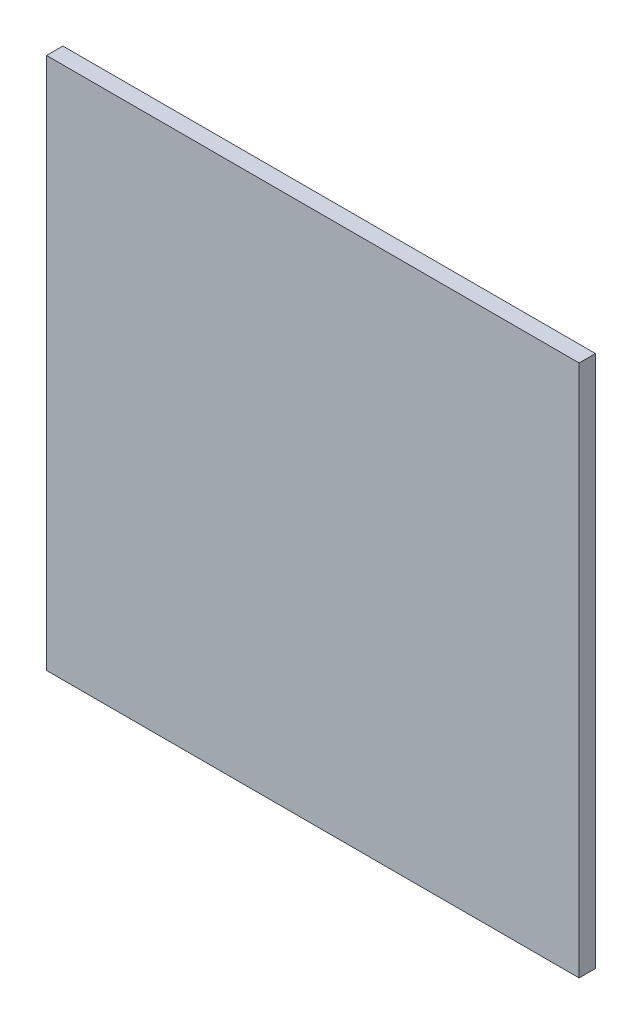
ISO-10303-21;
HEADER;
FILE_DESCRIPTION(('STEP AP214'),'2;1');
FILE_NAME('part.step','',(''),(''),'','','');
FILE_SCHEMA(('AUTOMOTIVE_DESIGN { 1 0 10303 214 1 1 1 1 }'));
ENDSEC;
DATA;
#1=APPLICATION_CONTEXT('core data for automotive mechanical design processes');
#2=APPLICATION_PROTOCOL_DEFINITION('international standard','automotive_design',2000,#1);
#3=PRODUCT_CONTEXT('',#1,'mechanical');
#4=PRODUCT('Part','Part','',(#3));
#5=PRODUCT_RELATED_PRODUCT_CATEGORY('part','',(#4));
#6=PRODUCT_DEFINITION_FORMATION('','',#4);
#7=PRODUCT_DEFINITION_CONTEXT('part definition',#1,'design');
#8=PRODUCT_DEFINITION('design','',#6,#7);
#9=PRODUCT_DEFINITION_SHAPE('','',#8);
#10=(LENGTH_UNIT() NAMED_UNIT(*) SI_UNIT(.MILLI.,.METRE.));
#11=(NAMED_UNIT(*) PLANE_ANGLE_UNIT() SI_UNIT($,.RADIAN.));
#12=(NAMED_UNIT(*) SI_UNIT($,.STERADIAN.) SOLID_ANGLE_UNIT());
#13=UNCERTAINTY_MEASURE_WITH_UNIT(LENGTH_MEASURE(1.E-05),#10,'distance_accuracy_value','');
#14=(GEOMETRIC_REPRESENTATION_CONTEXT(3) GLOBAL_UNCERTAINTY_ASSIGNED_CONTEXT((#13)) GLOBAL_UNIT_ASSIGNED_CONTEXT((#10,
#11,#12)) REPRESENTATION_CONTEXT('',''));
#15=CARTESIAN_POINT('',(0.,0.,0.));
#16=DIRECTION('',(0.,0.,1.));
#17=DIRECTION('',(1.,0.,0.));
#18=AXIS2_PLACEMENT_3D('',#15,#16,#17);
#19=CARTESIAN_POINT('',(266.243807327655,222.18972550358,2.3));
#20=DIRECTION('',(1.,0.,0.));
#21=DIRECTION('',(0.,1.,0.));
#22=AXIS2_PLACEMENT_3D('',#19,#20,#21);
#23=PLANE('',#22);
#24=DIRECTION('',(0.,-1.,0.));
#25=VECTOR('',#24,1.);
#26=CARTESIAN_POINT('',(266.243807327655,222.18972550358,0.));
#27=LINE('',#26,#25);
#28=CARTESIAN_POINT('',(266.243807327655,222.18972550358,0.));
#29=VERTEX_POINT('',#28);
#30=CARTESIAN_POINT('',(266.243807327655,147.18972550358,0.));
#31=VERTEX_POINT('',#30);
#32=EDGE_CURVE('E100',#29,#31,#27,.T.);
#33=ORIENTED_EDGE('',*,*,#32,.T.);
#34=DIRECTION('',(0.,0.,-1.));
#35=VECTOR('',#34,1.);
#36=CARTESIAN_POINT('',(266.243807327655,147.18972550358,2.3));
#37=LINE('',#36,#35);
#38=CARTESIAN_POINT('',(266.243807327655,147.18972550358,2.3));
#39=VERTEX_POINT('',#38);
#40=EDGE_CURVE('E11',#39,#31,#37,.T.);
#41=ORIENTED_EDGE('',*,*,#40,.F.);
#42=DIRECTION('',(0.,-1.,0.));
#43=VECTOR('',#42,1.);
#44=CARTESIAN_POINT('',(266.243807327655,222.18972550358,2.3));
#45=LINE('',#44,#43);
#46=CARTESIAN_POINT('',(266.243807327655,222.18972550358,2.3));
#47=VERTEX_POINT('',#46);
#48=EDGE_CURVE('E88',#47,#39,#45,.T.);
#49=ORIENTED_EDGE('',*,*,#48,.F.);
#50=DIRECTION('',(0.,0.,-1.));
#51=VECTOR('',#50,1.);
#52=CARTESIAN_POINT('',(266.243807327655,222.18972550358,2.3));
#53=LINE('',#52,#51);
#54=EDGE_CURVE('E96',#47,#29,#53,.T.);
#55=ORIENTED_EDGE('',*,*,#54,.T.);
#56=EDGE_LOOP('',(#33,#41,#49,#55));
#57=FACE_BOUND('',#56,.T.);
#58=ADVANCED_FACE('F37',(#57),#23,.F.);
#59=CARTESIAN_POINT('',(266.243807327655,147.18972550358,2.3));
#60=DIRECTION('',(0.,1.,0.));
#61=DIRECTION('',(0.,0.,1.));
#62=AXIS2_PLACEMENT_3D('',#59,#60,#61);
#63=PLANE('',#62);
#64=DIRECTION('',(1.,0.,0.));
#65=VECTOR('',#64,1.);
#66=CARTESIAN_POINT('',(266.243807327655,147.18972550358,0.));
#67=LINE('',#66,#65);
#68=CARTESIAN_POINT('',(341.243807327655,147.18972550358,0.));
#69=VERTEX_POINT('',#68);
#70=EDGE_CURVE('E92',#31,#69,#67,.T.);
#71=ORIENTED_EDGE('',*,*,#70,.T.);
#72=DIRECTION('',(0.,0.,-1.));
#73=VECTOR('',#72,1.);
#74=CARTESIAN_POINT('',(341.243807327655,147.18972550358,2.3));
#75=LINE('',#74,#73);
#76=CARTESIAN_POINT('',(341.243807327655,147.18972550358,2.3));
#77=VERTEX_POINT('',#76);
#78=EDGE_CURVE('E45',#77,#69,#75,.T.);
#79=ORIENTED_EDGE('',*,*,#78,.F.);
#80=DIRECTION('',(1.,0.,0.));
#81=VECTOR('',#80,1.);
#82=CARTESIAN_POINT('',(266.243807327655,147.18972550358,2.3));
#83=LINE('',#82,#81);
#84=EDGE_CURVE('E83',#39,#77,#83,.T.);
#85=ORIENTED_EDGE('',*,*,#84,.F.);
#86=ORIENTED_EDGE('',*,*,#40,.T.);
#87=EDGE_LOOP('',(#71,#79,#85,#86));
#88=FACE_BOUND('',#87,.T.);
#89=ADVANCED_FACE('F91',(#88),#63,.F.);
#90=CARTESIAN_POINT('',(341.243807327655,222.18972550358,2.3));
#91=DIRECTION('',(-1.,0.,0.));
#92=DIRECTION('',(0.,0.,1.));
#93=AXIS2_PLACEMENT_3D('',#90,#91,#92);
#94=PLANE('',#93);
#95=DIRECTION('',(0.,1.,0.));
#96=VECTOR('',#95,1.);
#97=CARTESIAN_POINT('',(341.243807327655,222.18972550358,0.));
#98=LINE('',#97,#96);
#99=CARTESIAN_POINT('',(341.243807327655,222.18972550358,0.));
#100=VERTEX_POINT('',#99);
#101=EDGE_CURVE('E70',#69,#100,#98,.T.);
#102=ORIENTED_EDGE('',*,*,#101,.T.);
#103=DIRECTION('',(0.,0.,-1.));
#104=VECTOR('',#103,1.);
#105=CARTESIAN_POINT('',(341.243807327655,222.18972550358,2.3));
#106=LINE('',#105,#104);
#107=CARTESIAN_POINT('',(341.243807327655,222.18972550358,2.3));
#108=VERTEX_POINT('',#107);
#109=EDGE_CURVE('E93',#108,#100,#106,.T.);
#110=ORIENTED_EDGE('',*,*,#109,.F.);
#111=DIRECTION('',(0.,1.,0.));
#112=VECTOR('',#111,1.);
#113=CARTESIAN_POINT('',(341.243807327655,222.18972550358,2.3));
#114=LINE('',#113,#112);
#115=EDGE_CURVE('E86',#77,#108,#114,.T.);
#116=ORIENTED_EDGE('',*,*,#115,.F.);
#117=ORIENTED_EDGE('',*,*,#78,.T.);
#118=EDGE_LOOP('',(#102,#110,#116,#117));
#119=FACE_BOUND('',#118,.T.);
#120=ADVANCED_FACE('F94',(#119),#94,.F.);
#121=CARTESIAN_POINT('',(266.243807327655,222.18972550358,2.3));
#122=DIRECTION('',(0.,-1.,0.));
#123=DIRECTION('',(0.,0.,-1.));
#124=AXIS2_PLACEMENT_3D('',#121,#122,#123);
#125=PLANE('',#124);
#126=DIRECTION('',(-1.,0.,0.));
#127=VECTOR('',#126,1.);
#128=CARTESIAN_POINT('',(266.243807327655,222.18972550358,0.));
#129=LINE('',#128,#127);
#130=EDGE_CURVE('E76',#100,#29,#129,.T.);
#131=ORIENTED_EDGE('',*,*,#130,.T.);
#132=ORIENTED_EDGE('',*,*,#54,.F.);
#133=DIRECTION('',(-1.,0.,0.));
#134=VECTOR('',#133,1.);
#135=CARTESIAN_POINT('',(266.243807327655,222.18972550358,2.3));
#136=LINE('',#135,#134);
#137=EDGE_CURVE('E53',#108,#47,#136,.T.);
#138=ORIENTED_EDGE('',*,*,#137,.F.);
#139=ORIENTED_EDGE('',*,*,#109,.T.);
#140=EDGE_LOOP('',(#131,#132,#138,#139));
#141=FACE_BOUND('',#140,.T.);
#142=ADVANCED_FACE('F107',(#141),#125,.F.);
#143=CARTESIAN_POINT('',(0.,0.,2.3));
#144=DIRECTION('',(0.,0.,1.));
#145=DIRECTION('',(1.,0.,0.));
#146=AXIS2_PLACEMENT_3D('',#143,#144,#145);
#147=PLANE('',#146);
#148=ORIENTED_EDGE('',*,*,#48,.T.);
#149=ORIENTED_EDGE('',*,*,#84,.T.);
#150=ORIENTED_EDGE('',*,*,#115,.T.);
#151=ORIENTED_EDGE('',*,*,#137,.T.);
#152=EDGE_LOOP('',(#148,#149,#150,#151));
#153=FACE_BOUND('',#152,.T.);
#154=ADVANCED_FACE('F84',(#153),#147,.T.);
#155=CARTESIAN_POINT('',(0.,0.,0.));
#156=DIRECTION('',(0.,0.,1.));
#157=DIRECTION('',(1.,0.,0.));
#158=AXIS2_PLACEMENT_3D('',#155,#156,#157);
#159=PLANE('',#158);
#160=ORIENTED_EDGE('',*,*,#32,.F.);
#161=ORIENTED_EDGE('',*,*,#130,.F.);
#162=ORIENTED_EDGE('',*,*,#101,.F.);
#163=ORIENTED_EDGE('',*,*,#70,.F.);
#164=EDGE_LOOP('',(#160,#161,#162,#163));
#165=FACE_BOUND('',#164,.T.);
#166=ADVANCED_FACE('F110',(#165),#159,.F.);
#167=CLOSED_SHELL('',(#58,#89,#120,#142,#154,#166));
#168=MANIFOLD_SOLID_BREP('B2',#167);
#169=ADVANCED_BREP_SHAPE_REPRESENTATION('',(#18,#168),#14);
#170=SHAPE_DEFINITION_REPRESENTATION(#9,#169);
ENDSEC;
END-ISO-10303-21;
